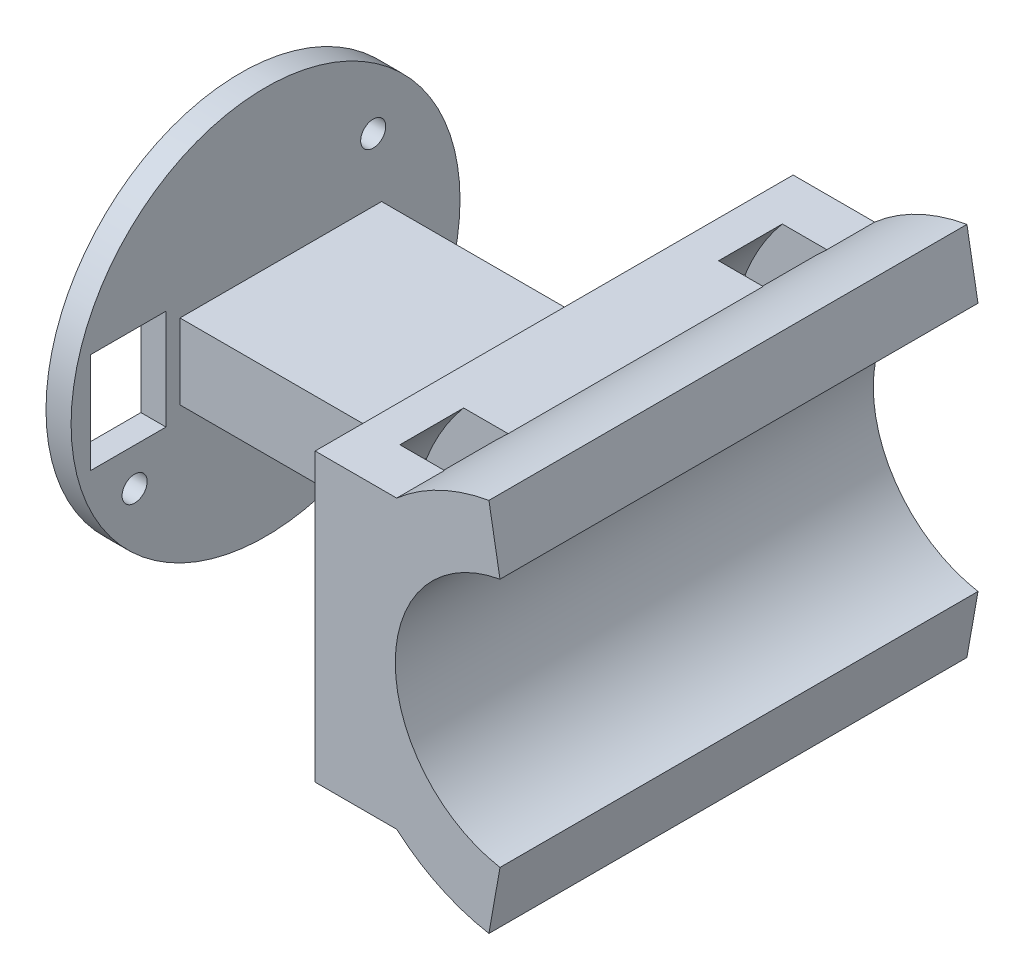
ISO-10303-21;
HEADER;
FILE_DESCRIPTION(('STEP AP214'),'2;1');
FILE_NAME('part.step','',(''),(''),'','','');
FILE_SCHEMA(('AUTOMOTIVE_DESIGN { 1 0 10303 214 1 1 1 1 }'));
ENDSEC;
DATA;
#1=APPLICATION_CONTEXT('core data for automotive mechanical design processes');
#2=APPLICATION_PROTOCOL_DEFINITION('international standard','automotive_design',2000,#1);
#3=PRODUCT_CONTEXT('',#1,'mechanical');
#4=PRODUCT('Part','Part','',(#3));
#5=PRODUCT_RELATED_PRODUCT_CATEGORY('part','',(#4));
#6=PRODUCT_DEFINITION_FORMATION('','',#4);
#7=PRODUCT_DEFINITION_CONTEXT('part definition',#1,'design');
#8=PRODUCT_DEFINITION('design','',#6,#7);
#9=PRODUCT_DEFINITION_SHAPE('','',#8);
#10=(LENGTH_UNIT() NAMED_UNIT(*) SI_UNIT(.MILLI.,.METRE.));
#11=(NAMED_UNIT(*) PLANE_ANGLE_UNIT() SI_UNIT($,.RADIAN.));
#12=(NAMED_UNIT(*) SI_UNIT($,.STERADIAN.) SOLID_ANGLE_UNIT());
#13=UNCERTAINTY_MEASURE_WITH_UNIT(LENGTH_MEASURE(1.E-05),#10,'distance_accuracy_value','');
#14=(GEOMETRIC_REPRESENTATION_CONTEXT(3) GLOBAL_UNCERTAINTY_ASSIGNED_CONTEXT((#13)) GLOBAL_UNIT_ASSIGNED_CONTEXT((#10,
#11,#12)) REPRESENTATION_CONTEXT('',''));
#15=CARTESIAN_POINT('',(0.,0.,0.));
#16=DIRECTION('',(0.,0.,1.));
#17=DIRECTION('',(1.,0.,0.));
#18=AXIS2_PLACEMENT_3D('',#15,#16,#17);
#19=CARTESIAN_POINT('',(-6.38936934946346,-11.43,19.05));
#20=DIRECTION('',(1.,0.,0.));
#21=DIRECTION('',(0.,1.,0.));
#22=AXIS2_PLACEMENT_3D('',#19,#20,#21);
#23=PLANE('',#22);
#24=DIRECTION('',(0.,0.,1.));
#25=VECTOR('',#24,1.);
#26=CARTESIAN_POINT('',(-6.38936934946345,-6.48838180573363,19.05));
#27=LINE('',#26,#25);
#28=CARTESIAN_POINT('',(-6.38936934946345,-6.48838180573363,-15.24));
#29=VERTEX_POINT('',#28);
#30=CARTESIAN_POINT('',(-6.38936934946346,-6.48838180573361,-10.16));
#31=VERTEX_POINT('',#30);
#32=EDGE_CURVE('E345',#29,#31,#27,.T.);
#33=ORIENTED_EDGE('',*,*,#32,.F.);
#34=DIRECTION('',(0.,1.,0.));
#35=VECTOR('',#34,1.);
#36=CARTESIAN_POINT('',(-6.38936934946346,-11.43,-15.24));
#37=LINE('',#36,#35);
#38=CARTESIAN_POINT('',(-6.38936934946345,6.48838180573364,-15.24));
#39=VERTEX_POINT('',#38);
#40=EDGE_CURVE('E330',#29,#39,#37,.T.);
#41=ORIENTED_EDGE('',*,*,#40,.T.);
#42=DIRECTION('',(0.,0.,1.));
#43=VECTOR('',#42,1.);
#44=CARTESIAN_POINT('',(-6.38936934946345,6.48838180573364,19.05));
#45=LINE('',#44,#43);
#46=CARTESIAN_POINT('',(-6.38936934946346,6.48838180573362,-10.16));
#47=VERTEX_POINT('',#46);
#48=EDGE_CURVE('E347',#47,#39,#45,.F.);
#49=ORIENTED_EDGE('',*,*,#48,.F.);
#50=DIRECTION('',(0.,1.,0.));
#51=VECTOR('',#50,1.);
#52=CARTESIAN_POINT('',(-6.38936934946346,-11.43,-10.16));
#53=LINE('',#52,#51);
#54=EDGE_CURVE('E322',#31,#47,#53,.T.);
#55=ORIENTED_EDGE('',*,*,#54,.F.);
#56=EDGE_LOOP('',(#33,#41,#49,#55));
#57=FACE_BOUND('',#56,.T.);
#58=DIRECTION('',(0.,-1.,0.));
#59=VECTOR('',#58,1.);
#60=CARTESIAN_POINT('',(-6.38936934946346,-3.,-9.2493893907033));
#61=LINE('',#60,#59);
#62=CARTESIAN_POINT('',(-6.38936934946346,3.,-9.2493893907033));
#63=VERTEX_POINT('',#62);
#64=CARTESIAN_POINT('',(-6.38936934946346,-3.,-9.2493893907033));
#65=VERTEX_POINT('',#64);
#66=EDGE_CURVE('E349',#63,#65,#61,.T.);
#67=ORIENTED_EDGE('',*,*,#66,.F.);
#68=DIRECTION('',(0.,0.,-1.));
#69=VECTOR('',#68,1.);
#70=CARTESIAN_POINT('',(-6.38936934946346,3.,-9.2493893907033));
#71=LINE('',#70,#69);
#72=CARTESIAN_POINT('',(-6.38936934946346,3.,6.82201027291285));
#73=VERTEX_POINT('',#72);
#74=EDGE_CURVE('E354',#73,#63,#71,.T.);
#75=ORIENTED_EDGE('',*,*,#74,.F.);
#76=DIRECTION('',(0.,1.,0.));
#77=VECTOR('',#76,1.);
#78=CARTESIAN_POINT('',(-6.38936934946346,-3.,6.82201027291285));
#79=LINE('',#78,#77);
#80=CARTESIAN_POINT('',(-6.38936934946346,-3.,6.82201027291285));
#81=VERTEX_POINT('',#80);
#82=EDGE_CURVE('E369',#81,#73,#79,.T.);
#83=ORIENTED_EDGE('',*,*,#82,.F.);
#84=DIRECTION('',(0.,0.,1.));
#85=VECTOR('',#84,1.);
#86=CARTESIAN_POINT('',(-6.38936934946346,-3.,-9.2493893907033));
#87=LINE('',#86,#85);
#88=EDGE_CURVE('E366',#65,#81,#87,.T.);
#89=ORIENTED_EDGE('',*,*,#88,.F.);
#90=EDGE_LOOP('',(#67,#75,#83,#89));
#91=FACE_BOUND('',#90,.T.);
#92=DIRECTION('',(0.,-1.,0.));
#93=VECTOR('',#92,1.);
#94=CARTESIAN_POINT('',(-6.38936934946346,-11.43,-19.05));
#95=LINE('',#94,#93);
#96=CARTESIAN_POINT('',(-6.38936934946346,11.43,-19.05));
#97=VERTEX_POINT('',#96);
#98=CARTESIAN_POINT('',(-6.38936934946346,-11.43,-19.05));
#99=VERTEX_POINT('',#98);
#100=EDGE_CURVE('E415',#97,#99,#95,.T.);
#101=ORIENTED_EDGE('',*,*,#100,.T.);
#102=DIRECTION('',(0.,0.,-1.));
#103=VECTOR('',#102,1.);
#104=CARTESIAN_POINT('',(-6.38936934946346,-11.43,19.05));
#105=LINE('',#104,#103);
#106=CARTESIAN_POINT('',(-6.38936934946346,-11.43,19.05));
#107=VERTEX_POINT('',#106);
#108=EDGE_CURVE('E432',#107,#99,#105,.T.);
#109=ORIENTED_EDGE('',*,*,#108,.F.);
#110=DIRECTION('',(0.,-1.,0.));
#111=VECTOR('',#110,1.);
#112=CARTESIAN_POINT('',(-6.38936934946346,-11.43,19.05));
#113=LINE('',#112,#111);
#114=CARTESIAN_POINT('',(-6.38936934946346,11.43,19.05));
#115=VERTEX_POINT('',#114);
#116=EDGE_CURVE('E396',#115,#107,#113,.T.);
#117=ORIENTED_EDGE('',*,*,#116,.F.);
#118=DIRECTION('',(0.,0.,-1.));
#119=VECTOR('',#118,1.);
#120=CARTESIAN_POINT('',(-6.38936934946346,11.43,19.05));
#121=LINE('',#120,#119);
#122=EDGE_CURVE('E436',#115,#97,#121,.T.);
#123=ORIENTED_EDGE('',*,*,#122,.T.);
#124=EDGE_LOOP('',(#101,#109,#117,#123));
#125=FACE_BOUND('',#124,.T.);
#126=DIRECTION('',(0.,1.,0.));
#127=VECTOR('',#126,1.);
#128=CARTESIAN_POINT('',(-6.38936934946346,-11.43,15.24));
#129=LINE('',#128,#127);
#130=CARTESIAN_POINT('',(-6.38936934946346,-6.48838180573362,15.24));
#131=VERTEX_POINT('',#130);
#132=CARTESIAN_POINT('',(-6.38936934946346,6.48838180573363,15.24));
#133=VERTEX_POINT('',#132);
#134=EDGE_CURVE('E316',#131,#133,#129,.T.);
#135=ORIENTED_EDGE('',*,*,#134,.F.);
#136=DIRECTION('',(0.,0.,1.));
#137=VECTOR('',#136,1.);
#138=CARTESIAN_POINT('',(-6.38936934946345,-6.48838180573364,19.05));
#139=LINE('',#138,#137);
#140=CARTESIAN_POINT('',(-6.38936934946346,-6.48838180573362,10.16));
#141=VERTEX_POINT('',#140);
#142=EDGE_CURVE('E336',#131,#141,#139,.F.);
#143=ORIENTED_EDGE('',*,*,#142,.T.);
#144=DIRECTION('',(0.,1.,0.));
#145=VECTOR('',#144,1.);
#146=CARTESIAN_POINT('',(-6.38936934946346,-11.43,10.16));
#147=LINE('',#146,#145);
#148=CARTESIAN_POINT('',(-6.38936934946346,6.48838180573363,10.16));
#149=VERTEX_POINT('',#148);
#150=EDGE_CURVE('E309',#141,#149,#147,.T.);
#151=ORIENTED_EDGE('',*,*,#150,.T.);
#152=DIRECTION('',(0.,0.,1.));
#153=VECTOR('',#152,1.);
#154=CARTESIAN_POINT('',(-6.38936934946345,6.48838180573365,19.05));
#155=LINE('',#154,#153);
#156=EDGE_CURVE('E339',#149,#133,#155,.T.);
#157=ORIENTED_EDGE('',*,*,#156,.T.);
#158=EDGE_LOOP('',(#135,#143,#151,#157));
#159=FACE_BOUND('',#158,.T.);
#160=ADVANCED_FACE('F45',(#57,#91,#125,#159),#23,.F.);
#161=CARTESIAN_POINT('',(0.110630650536534,11.43,19.05));
#162=DIRECTION('',(0.,-1.,0.));
#163=DIRECTION('',(1.,0.,0.));
#164=AXIS2_PLACEMENT_3D('',#161,#162,#163);
#165=PLANE('',#164);
#166=DIRECTION('',(0.,0.,1.));
#167=VECTOR('',#166,1.);
#168=CARTESIAN_POINT('',(-3.44080869076881,11.43,19.05));
#169=LINE('',#168,#167);
#170=CARTESIAN_POINT('',(-3.44080869076881,11.43,-15.24));
#171=VERTEX_POINT('',#170);
#172=CARTESIAN_POINT('',(-3.44080869076881,11.43,-10.16));
#173=VERTEX_POINT('',#172);
#174=EDGE_CURVE('E342',#171,#173,#169,.T.);
#175=ORIENTED_EDGE('',*,*,#174,.F.);
#176=DIRECTION('',(1.,0.,0.));
#177=VECTOR('',#176,1.);
#178=CARTESIAN_POINT('',(0.110630650536534,11.43,-15.24));
#179=LINE('',#178,#177);
#180=CARTESIAN_POINT('',(0.110630650536533,11.43,-15.24));
#181=VERTEX_POINT('',#180);
#182=EDGE_CURVE('E327',#171,#181,#179,.T.);
#183=ORIENTED_EDGE('',*,*,#182,.T.);
#184=DIRECTION('',(0.,0.,-1.));
#185=VECTOR('',#184,1.);
#186=CARTESIAN_POINT('',(0.110630650536534,11.43,19.05));
#187=LINE('',#186,#185);
#188=CARTESIAN_POINT('',(0.110630650536534,11.43,-19.05));
#189=VERTEX_POINT('',#188);
#190=EDGE_CURVE('E439',#181,#189,#187,.T.);
#191=ORIENTED_EDGE('',*,*,#190,.T.);
#192=DIRECTION('',(-1.,0.,0.));
#193=VECTOR('',#192,1.);
#194=CARTESIAN_POINT('',(0.110630650536534,11.43,-19.05));
#195=LINE('',#194,#193);
#196=EDGE_CURVE('E413',#189,#97,#195,.T.);
#197=ORIENTED_EDGE('',*,*,#196,.T.);
#198=ORIENTED_EDGE('',*,*,#122,.F.);
#199=DIRECTION('',(-1.,0.,0.));
#200=VECTOR('',#199,1.);
#201=CARTESIAN_POINT('',(0.110630650536534,11.43,19.05));
#202=LINE('',#201,#200);
#203=CARTESIAN_POINT('',(0.110630650536534,11.43,19.05));
#204=VERTEX_POINT('',#203);
#205=EDGE_CURVE('E394',#204,#115,#202,.T.);
#206=ORIENTED_EDGE('',*,*,#205,.F.);
#207=CARTESIAN_POINT('',(0.110630650536528,11.43,15.24));
#208=VERTEX_POINT('',#207);
#209=EDGE_CURVE('E440',#204,#208,#187,.T.);
#210=ORIENTED_EDGE('',*,*,#209,.T.);
#211=DIRECTION('',(1.,0.,0.));
#212=VECTOR('',#211,1.);
#213=CARTESIAN_POINT('',(0.110630650536534,11.43,15.24));
#214=LINE('',#213,#212);
#215=CARTESIAN_POINT('',(-3.44080869076881,11.43,15.24));
#216=VERTEX_POINT('',#215);
#217=EDGE_CURVE('E314',#216,#208,#214,.T.);
#218=ORIENTED_EDGE('',*,*,#217,.F.);
#219=DIRECTION('',(0.,0.,1.));
#220=VECTOR('',#219,1.);
#221=CARTESIAN_POINT('',(-3.44080869076881,11.43,19.05));
#222=LINE('',#221,#220);
#223=CARTESIAN_POINT('',(-3.44080869076881,11.43,10.16));
#224=VERTEX_POINT('',#223);
#225=EDGE_CURVE('E333',#216,#224,#222,.F.);
#226=ORIENTED_EDGE('',*,*,#225,.T.);
#227=DIRECTION('',(1.,0.,0.));
#228=VECTOR('',#227,1.);
#229=CARTESIAN_POINT('',(0.110630650536534,11.43,10.16));
#230=LINE('',#229,#228);
#231=CARTESIAN_POINT('',(0.110630650536534,11.43,10.16));
#232=VERTEX_POINT('',#231);
#233=EDGE_CURVE('E306',#224,#232,#230,.T.);
#234=ORIENTED_EDGE('',*,*,#233,.T.);
#235=CARTESIAN_POINT('',(0.110630650536537,11.43,-10.16));
#236=VERTEX_POINT('',#235);
#237=EDGE_CURVE('E444',#232,#236,#187,.T.);
#238=ORIENTED_EDGE('',*,*,#237,.T.);
#239=DIRECTION('',(1.,0.,0.));
#240=VECTOR('',#239,1.);
#241=CARTESIAN_POINT('',(0.110630650536534,11.43,-10.16));
#242=LINE('',#241,#240);
#243=EDGE_CURVE('E320',#173,#236,#242,.T.);
#244=ORIENTED_EDGE('',*,*,#243,.F.);
#245=EDGE_LOOP('',(#175,#183,#191,#197,#198,#206,#210,#218,#226,#234,#238,#244));
#246=FACE_BOUND('',#245,.T.);
#247=ADVANCED_FACE('F472',(#246),#165,.F.);
#248=CARTESIAN_POINT('',(0.110630650536537,-11.43,19.05));
#249=DIRECTION('',(0.,1.,0.));
#250=DIRECTION('',(-1.,0.,0.));
#251=AXIS2_PLACEMENT_3D('',#248,#249,#250);
#252=PLANE('',#251);
#253=DIRECTION('',(0.,0.,-1.));
#254=VECTOR('',#253,1.);
#255=CARTESIAN_POINT('',(0.11063065053654,-11.43,19.05));
#256=LINE('',#255,#254);
#257=CARTESIAN_POINT('',(0.110630650536542,-11.43,-15.24));
#258=VERTEX_POINT('',#257);
#259=CARTESIAN_POINT('',(0.11063065053654,-11.43,-19.05));
#260=VERTEX_POINT('',#259);
#261=EDGE_CURVE('E428',#258,#260,#256,.T.);
#262=ORIENTED_EDGE('',*,*,#261,.F.);
#263=DIRECTION('',(-1.,0.,0.));
#264=VECTOR('',#263,1.);
#265=CARTESIAN_POINT('',(0.110630650536537,-11.43,-15.24));
#266=LINE('',#265,#264);
#267=CARTESIAN_POINT('',(-3.4408086907688,-11.43,-15.24));
#268=VERTEX_POINT('',#267);
#269=EDGE_CURVE('E324',#258,#268,#266,.T.);
#270=ORIENTED_EDGE('',*,*,#269,.T.);
#271=DIRECTION('',(0.,0.,1.));
#272=VECTOR('',#271,1.);
#273=CARTESIAN_POINT('',(-3.4408086907688,-11.43,19.05));
#274=LINE('',#273,#272);
#275=CARTESIAN_POINT('',(-3.4408086907688,-11.43,-10.16));
#276=VERTEX_POINT('',#275);
#277=EDGE_CURVE('E11',#276,#268,#274,.F.);
#278=ORIENTED_EDGE('',*,*,#277,.F.);
#279=DIRECTION('',(-1.,0.,0.));
#280=VECTOR('',#279,1.);
#281=CARTESIAN_POINT('',(0.110630650536537,-11.43,-10.16));
#282=LINE('',#281,#280);
#283=CARTESIAN_POINT('',(0.11063065053654,-11.43,-10.16));
#284=VERTEX_POINT('',#283);
#285=EDGE_CURVE('E318',#284,#276,#282,.T.);
#286=ORIENTED_EDGE('',*,*,#285,.F.);
#287=CARTESIAN_POINT('',(0.11063065053654,-11.43,10.16));
#288=VERTEX_POINT('',#287);
#289=EDGE_CURVE('E433',#288,#284,#256,.T.);
#290=ORIENTED_EDGE('',*,*,#289,.F.);
#291=DIRECTION('',(-1.,0.,0.));
#292=VECTOR('',#291,1.);
#293=CARTESIAN_POINT('',(0.110630650536537,-11.43,10.16));
#294=LINE('',#293,#292);
#295=CARTESIAN_POINT('',(-3.44080869076881,-11.43,10.16));
#296=VERTEX_POINT('',#295);
#297=EDGE_CURVE('E294',#288,#296,#294,.T.);
#298=ORIENTED_EDGE('',*,*,#297,.T.);
#299=DIRECTION('',(0.,0.,1.));
#300=VECTOR('',#299,1.);
#301=CARTESIAN_POINT('',(-3.44080869076881,-11.43,19.05));
#302=LINE('',#301,#300);
#303=CARTESIAN_POINT('',(-3.44080869076881,-11.43,15.24));
#304=VERTEX_POINT('',#303);
#305=EDGE_CURVE('E53',#296,#304,#302,.T.);
#306=ORIENTED_EDGE('',*,*,#305,.T.);
#307=DIRECTION('',(-1.,0.,0.));
#308=VECTOR('',#307,1.);
#309=CARTESIAN_POINT('',(0.110630650536537,-11.43,15.24));
#310=LINE('',#309,#308);
#311=CARTESIAN_POINT('',(0.11063065053654,-11.43,15.24));
#312=VERTEX_POINT('',#311);
#313=EDGE_CURVE('E312',#312,#304,#310,.T.);
#314=ORIENTED_EDGE('',*,*,#313,.F.);
#315=CARTESIAN_POINT('',(0.11063065053654,-11.43,19.05));
#316=VERTEX_POINT('',#315);
#317=EDGE_CURVE('E429',#316,#312,#256,.T.);
#318=ORIENTED_EDGE('',*,*,#317,.F.);
#319=DIRECTION('',(1.,0.,0.));
#320=VECTOR('',#319,1.);
#321=CARTESIAN_POINT('',(0.110630650536537,-11.43,19.05));
#322=LINE('',#321,#320);
#323=EDGE_CURVE('E398',#107,#316,#322,.T.);
#324=ORIENTED_EDGE('',*,*,#323,.F.);
#325=ORIENTED_EDGE('',*,*,#108,.T.);
#326=DIRECTION('',(1.,0.,0.));
#327=VECTOR('',#326,1.);
#328=CARTESIAN_POINT('',(0.110630650536537,-11.43,-19.05));
#329=LINE('',#328,#327);
#330=EDGE_CURVE('E417',#99,#260,#329,.T.);
#331=ORIENTED_EDGE('',*,*,#330,.T.);
#332=EDGE_LOOP('',(#262,#270,#278,#286,#290,#298,#306,#314,#318,#324,#325,#331));
#333=FACE_BOUND('',#332,.T.);
#334=ADVANCED_FACE('F453',(#333),#252,.F.);
#335=CARTESIAN_POINT('',(10.1,0.,19.05));
#336=DIRECTION('',(0.,0.,-1.));
#337=DIRECTION('',(-1.,0.,0.));
#338=AXIS2_PLACEMENT_3D('',#335,#336,#337);
#339=CYLINDRICAL_SURFACE('',#338,10.1);
#340=CARTESIAN_POINT('',(10.1,0.,-19.05));
#341=DIRECTION('',(0.,0.,-1.));
#342=DIRECTION('',(-1.,0.,0.));
#343=AXIS2_PLACEMENT_3D('',#340,#341,#342);
#344=CIRCLE('',#343,10.1);
#345=CARTESIAN_POINT('',(8.34615340556399,-9.9465583054233,-19.05));
#346=VERTEX_POINT('',#345);
#347=CARTESIAN_POINT('',(8.34615340556399,9.9465583054233,-19.05));
#348=VERTEX_POINT('',#347);
#349=EDGE_CURVE('E385',#346,#348,#344,.T.);
#350=ORIENTED_EDGE('',*,*,#349,.T.);
#351=DIRECTION('',(0.,0.,-1.));
#352=VECTOR('',#351,1.);
#353=CARTESIAN_POINT('',(8.34615340556399,9.9465583054233,19.05));
#354=LINE('',#353,#352);
#355=CARTESIAN_POINT('',(8.34615340556399,9.9465583054233,19.05));
#356=VERTEX_POINT('',#355);
#357=EDGE_CURVE('E446',#356,#348,#354,.T.);
#358=ORIENTED_EDGE('',*,*,#357,.F.);
#359=CARTESIAN_POINT('',(10.1,0.,19.05));
#360=DIRECTION('',(0.,0.,-1.));
#361=DIRECTION('',(-1.,0.,0.));
#362=AXIS2_PLACEMENT_3D('',#359,#360,#361);
#363=CIRCLE('',#362,10.1);
#364=CARTESIAN_POINT('',(8.34615340556399,-9.9465583054233,19.05));
#365=VERTEX_POINT('',#364);
#366=EDGE_CURVE('E386',#365,#356,#363,.T.);
#367=ORIENTED_EDGE('',*,*,#366,.F.);
#368=DIRECTION('',(0.,0.,-1.));
#369=VECTOR('',#368,1.);
#370=CARTESIAN_POINT('',(8.34615340556399,-9.9465583054233,19.05));
#371=LINE('',#370,#369);
#372=EDGE_CURVE('E404',#365,#346,#371,.T.);
#373=ORIENTED_EDGE('',*,*,#372,.T.);
#374=EDGE_LOOP('',(#350,#358,#367,#373));
#375=FACE_BOUND('',#374,.T.);
#376=ADVANCED_FACE('F47',(#375),#339,.F.);
#377=CARTESIAN_POINT('',(8.34615340556399,9.9465583054233,19.05));
#378=DIRECTION('',(-0.984807753012208,-0.173648177666931,0.));
#379=DIRECTION('',(0.173648177666931,-0.984807753012208,0.));
#380=AXIS2_PLACEMENT_3D('',#377,#378,#379);
#381=PLANE('',#380);
#382=DIRECTION('',(-0.173648177666931,0.984807753012208,0.));
#383=VECTOR('',#382,1.);
#384=CARTESIAN_POINT('',(8.34615340556399,9.9465583054233,-19.05));
#385=LINE('',#384,#383);
#386=CARTESIAN_POINT('',(7.46402066301598,14.9493816907253,-19.05));
#387=VERTEX_POINT('',#386);
#388=EDGE_CURVE('E407',#348,#387,#385,.T.);
#389=ORIENTED_EDGE('',*,*,#388,.T.);
#390=DIRECTION('',(0.,0.,-1.));
#391=VECTOR('',#390,1.);
#392=CARTESIAN_POINT('',(7.46402066301598,14.9493816907253,19.05));
#393=LINE('',#392,#391);
#394=CARTESIAN_POINT('',(7.46402066301598,14.9493816907253,19.05));
#395=VERTEX_POINT('',#394);
#396=EDGE_CURVE('E443',#395,#387,#393,.T.);
#397=ORIENTED_EDGE('',*,*,#396,.F.);
#398=DIRECTION('',(-0.173648177666931,0.984807753012208,0.));
#399=VECTOR('',#398,1.);
#400=CARTESIAN_POINT('',(8.34615340556399,9.9465583054233,19.05));
#401=LINE('',#400,#399);
#402=EDGE_CURVE('E389',#356,#395,#401,.T.);
#403=ORIENTED_EDGE('',*,*,#402,.F.);
#404=ORIENTED_EDGE('',*,*,#357,.T.);
#405=EDGE_LOOP('',(#389,#397,#403,#404));
#406=FACE_BOUND('',#405,.T.);
#407=ADVANCED_FACE('F521',(#406),#381,.F.);
#408=CARTESIAN_POINT('',(10.1,0.,19.05));
#409=DIRECTION('',(0.,0.,-1.));
#410=DIRECTION('',(-1.,0.,0.));
#411=AXIS2_PLACEMENT_3D('',#408,#409,#410);
#412=CYLINDRICAL_SURFACE('',#411,15.18);
#413=ORIENTED_EDGE('',*,*,#396,.T.);
#414=CARTESIAN_POINT('',(10.1,0.,-19.05));
#415=DIRECTION('',(0.,0.,1.));
#416=DIRECTION('',(-1.,0.,0.));
#417=AXIS2_PLACEMENT_3D('',#414,#415,#416);
#418=CIRCLE('',#417,15.18);
#419=EDGE_CURVE('E410',#387,#189,#418,.T.);
#420=ORIENTED_EDGE('',*,*,#419,.T.);
#421=ORIENTED_EDGE('',*,*,#190,.F.);
#422=CARTESIAN_POINT('',(10.1,0.,-15.24));
#423=DIRECTION('',(0.,0.,1.));
#424=DIRECTION('',(1.,0.,0.));
#425=AXIS2_PLACEMENT_3D('',#422,#423,#424);
#426=CIRCLE('',#425,15.18);
#427=EDGE_CURVE('E291',#181,#258,#426,.T.);
#428=ORIENTED_EDGE('',*,*,#427,.T.);
#429=ORIENTED_EDGE('',*,*,#261,.T.);
#430=CARTESIAN_POINT('',(10.1,0.,-19.05));
#431=DIRECTION('',(0.,0.,1.));
#432=DIRECTION('',(-1.,0.,0.));
#433=AXIS2_PLACEMENT_3D('',#430,#431,#432);
#434=CIRCLE('',#433,15.18);
#435=CARTESIAN_POINT('',(7.46402066301598,-14.9493816907253,-19.05));
#436=VERTEX_POINT('',#435);
#437=EDGE_CURVE('E420',#260,#436,#434,.T.);
#438=ORIENTED_EDGE('',*,*,#437,.T.);
#439=DIRECTION('',(0.,0.,-1.));
#440=VECTOR('',#439,1.);
#441=CARTESIAN_POINT('',(7.46402066301598,-14.9493816907253,19.05));
#442=LINE('',#441,#440);
#443=CARTESIAN_POINT('',(7.46402066301598,-14.9493816907253,19.05));
#444=VERTEX_POINT('',#443);
#445=EDGE_CURVE('E426',#444,#436,#442,.T.);
#446=ORIENTED_EDGE('',*,*,#445,.F.);
#447=CARTESIAN_POINT('',(10.1,0.,19.05));
#448=DIRECTION('',(0.,0.,1.));
#449=DIRECTION('',(-1.,0.,0.));
#450=AXIS2_PLACEMENT_3D('',#447,#448,#449);
#451=CIRCLE('',#450,15.18);
#452=EDGE_CURVE('E400',#316,#444,#451,.T.);
#453=ORIENTED_EDGE('',*,*,#452,.F.);
#454=ORIENTED_EDGE('',*,*,#317,.T.);
#455=CARTESIAN_POINT('',(10.1,0.,15.24));
#456=DIRECTION('',(0.,0.,1.));
#457=DIRECTION('',(1.,0.,0.));
#458=AXIS2_PLACEMENT_3D('',#455,#456,#457);
#459=CIRCLE('',#458,15.18);
#460=EDGE_CURVE('E299',#208,#312,#459,.T.);
#461=ORIENTED_EDGE('',*,*,#460,.F.);
#462=ORIENTED_EDGE('',*,*,#209,.F.);
#463=CARTESIAN_POINT('',(10.1,0.,19.05));
#464=DIRECTION('',(0.,0.,1.));
#465=DIRECTION('',(-1.,0.,0.));
#466=AXIS2_PLACEMENT_3D('',#463,#464,#465);
#467=CIRCLE('',#466,15.18);
#468=EDGE_CURVE('E392',#395,#204,#467,.T.);
#469=ORIENTED_EDGE('',*,*,#468,.F.);
#470=EDGE_LOOP('',(#413,#420,#421,#428,#429,#438,#446,#453,#454,#461,#462,#469));
#471=FACE_BOUND('',#470,.T.);
#472=CARTESIAN_POINT('',(10.1,0.,-10.16));
#473=DIRECTION('',(0.,0.,1.));
#474=DIRECTION('',(1.,0.,0.));
#475=AXIS2_PLACEMENT_3D('',#472,#473,#474);
#476=CIRCLE('',#475,15.18);
#477=EDGE_CURVE('E281',#236,#284,#476,.T.);
#478=ORIENTED_EDGE('',*,*,#477,.F.);
#479=ORIENTED_EDGE('',*,*,#237,.F.);
#480=CARTESIAN_POINT('',(10.1,0.,10.16));
#481=DIRECTION('',(0.,0.,1.));
#482=DIRECTION('',(1.,0.,0.));
#483=AXIS2_PLACEMENT_3D('',#480,#481,#482);
#484=CIRCLE('',#483,15.18);
#485=EDGE_CURVE('E296',#232,#288,#484,.T.);
#486=ORIENTED_EDGE('',*,*,#485,.T.);
#487=ORIENTED_EDGE('',*,*,#289,.T.);
#488=EDGE_LOOP('',(#478,#479,#486,#487));
#489=FACE_BOUND('',#488,.T.);
#490=ADVANCED_FACE('F478',(#471,#489),#412,.T.);
#491=CARTESIAN_POINT('',(8.34615340556399,-9.9465583054233,19.05));
#492=DIRECTION('',(-0.984807753012208,0.173648177666931,0.));
#493=DIRECTION('',(-0.173648177666931,-0.984807753012208,0.));
#494=AXIS2_PLACEMENT_3D('',#491,#492,#493);
#495=PLANE('',#494);
#496=DIRECTION('',(0.173648177666931,0.984807753012208,0.));
#497=VECTOR('',#496,1.);
#498=CARTESIAN_POINT('',(8.34615340556399,-9.9465583054233,-19.05));
#499=LINE('',#498,#497);
#500=EDGE_CURVE('E390',#436,#346,#499,.T.);
#501=ORIENTED_EDGE('',*,*,#500,.T.);
#502=ORIENTED_EDGE('',*,*,#372,.F.);
#503=DIRECTION('',(0.173648177666931,0.984807753012208,0.));
#504=VECTOR('',#503,1.);
#505=CARTESIAN_POINT('',(8.34615340556399,-9.9465583054233,19.05));
#506=LINE('',#505,#504);
#507=EDGE_CURVE('E402',#444,#365,#506,.T.);
#508=ORIENTED_EDGE('',*,*,#507,.F.);
#509=ORIENTED_EDGE('',*,*,#445,.T.);
#510=EDGE_LOOP('',(#501,#502,#508,#509));
#511=FACE_BOUND('',#510,.T.);
#512=ADVANCED_FACE('F527',(#511),#495,.F.);
#513=CARTESIAN_POINT('',(10.1,0.,19.05));
#514=DIRECTION('',(0.,0.,-1.));
#515=DIRECTION('',(-1.,0.,0.));
#516=AXIS2_PLACEMENT_3D('',#513,#514,#515);
#517=PLANE('',#516);
#518=ORIENTED_EDGE('',*,*,#366,.T.);
#519=ORIENTED_EDGE('',*,*,#402,.T.);
#520=ORIENTED_EDGE('',*,*,#468,.T.);
#521=ORIENTED_EDGE('',*,*,#205,.T.);
#522=ORIENTED_EDGE('',*,*,#116,.T.);
#523=ORIENTED_EDGE('',*,*,#323,.T.);
#524=ORIENTED_EDGE('',*,*,#452,.T.);
#525=ORIENTED_EDGE('',*,*,#507,.T.);
#526=EDGE_LOOP('',(#518,#519,#520,#521,#522,#523,#524,#525));
#527=FACE_BOUND('',#526,.T.);
#528=ADVANCED_FACE('F486',(#527),#517,.F.);
#529=CARTESIAN_POINT('',(10.1,0.,-19.05));
#530=DIRECTION('',(0.,0.,-1.));
#531=DIRECTION('',(-1.,0.,0.));
#532=AXIS2_PLACEMENT_3D('',#529,#530,#531);
#533=PLANE('',#532);
#534=ORIENTED_EDGE('',*,*,#349,.F.);
#535=ORIENTED_EDGE('',*,*,#500,.F.);
#536=ORIENTED_EDGE('',*,*,#437,.F.);
#537=ORIENTED_EDGE('',*,*,#330,.F.);
#538=ORIENTED_EDGE('',*,*,#100,.F.);
#539=ORIENTED_EDGE('',*,*,#196,.F.);
#540=ORIENTED_EDGE('',*,*,#419,.F.);
#541=ORIENTED_EDGE('',*,*,#388,.F.);
#542=EDGE_LOOP('',(#534,#535,#536,#537,#538,#539,#540,#541));
#543=FACE_BOUND('',#542,.T.);
#544=ADVANCED_FACE('F493',(#543),#533,.T.);
#545=CARTESIAN_POINT('',(-29.3893693494635,-3.,-9.2493893907033));
#546=DIRECTION('',(0.,0.,1.));
#547=DIRECTION('',(1.,0.,0.));
#548=AXIS2_PLACEMENT_3D('',#545,#546,#547);
#549=PLANE('',#548);
#550=ORIENTED_EDGE('',*,*,#66,.T.);
#551=DIRECTION('',(1.,0.,0.));
#552=VECTOR('',#551,1.);
#553=CARTESIAN_POINT('',(-29.3893693494635,-3.,-9.2493893907033));
#554=LINE('',#553,#552);
#555=CARTESIAN_POINT('',(-29.3893693494635,-3.,-9.2493893907033));
#556=VERTEX_POINT('',#555);
#557=EDGE_CURVE('E382',#556,#65,#554,.T.);
#558=ORIENTED_EDGE('',*,*,#557,.F.);
#559=DIRECTION('',(0.,-1.,0.));
#560=VECTOR('',#559,1.);
#561=CARTESIAN_POINT('',(-29.3893693494635,-3.,-9.2493893907033));
#562=LINE('',#561,#560);
#563=CARTESIAN_POINT('',(-29.3893693494635,3.,-9.2493893907033));
#564=VERTEX_POINT('',#563);
#565=EDGE_CURVE('E350',#564,#556,#562,.T.);
#566=ORIENTED_EDGE('',*,*,#565,.F.);
#567=DIRECTION('',(1.,0.,0.));
#568=VECTOR('',#567,1.);
#569=CARTESIAN_POINT('',(-29.3893693494635,3.,-9.2493893907033));
#570=LINE('',#569,#568);
#571=EDGE_CURVE('E363',#564,#63,#570,.T.);
#572=ORIENTED_EDGE('',*,*,#571,.T.);
#573=EDGE_LOOP('',(#550,#558,#566,#572));
#574=FACE_BOUND('',#573,.T.);
#575=ADVANCED_FACE('F735',(#574),#549,.F.);
#576=CARTESIAN_POINT('',(-29.3893693494635,-3.,-9.2493893907033));
#577=DIRECTION('',(0.,1.,0.));
#578=DIRECTION('',(0.,0.,1.));
#579=AXIS2_PLACEMENT_3D('',#576,#577,#578);
#580=PLANE('',#579);
#581=ORIENTED_EDGE('',*,*,#88,.T.);
#582=DIRECTION('',(1.,0.,0.));
#583=VECTOR('',#582,1.);
#584=CARTESIAN_POINT('',(-29.3893693494635,-3.,6.82201027291285));
#585=LINE('',#584,#583);
#586=CARTESIAN_POINT('',(-29.3893693494635,-3.,6.82201027291285));
#587=VERTEX_POINT('',#586);
#588=EDGE_CURVE('E379',#587,#81,#585,.T.);
#589=ORIENTED_EDGE('',*,*,#588,.F.);
#590=DIRECTION('',(0.,0.,1.));
#591=VECTOR('',#590,1.);
#592=CARTESIAN_POINT('',(-29.3893693494635,-3.,-9.2493893907033));
#593=LINE('',#592,#591);
#594=EDGE_CURVE('E353',#556,#587,#593,.T.);
#595=ORIENTED_EDGE('',*,*,#594,.F.);
#596=ORIENTED_EDGE('',*,*,#557,.T.);
#597=EDGE_LOOP('',(#581,#589,#595,#596));
#598=FACE_BOUND('',#597,.T.);
#599=ADVANCED_FACE('F726',(#598),#580,.F.);
#600=CARTESIAN_POINT('',(-29.3893693494635,-3.,6.82201027291285));
#601=DIRECTION('',(0.,0.,-1.));
#602=DIRECTION('',(-1.,0.,0.));
#603=AXIS2_PLACEMENT_3D('',#600,#601,#602);
#604=PLANE('',#603);
#605=ORIENTED_EDGE('',*,*,#82,.T.);
#606=DIRECTION('',(1.,0.,0.));
#607=VECTOR('',#606,1.);
#608=CARTESIAN_POINT('',(-29.3893693494635,3.,6.82201027291285));
#609=LINE('',#608,#607);
#610=CARTESIAN_POINT('',(-29.3893693494635,3.,6.82201027291285));
#611=VERTEX_POINT('',#610);
#612=EDGE_CURVE('E376',#611,#73,#609,.T.);
#613=ORIENTED_EDGE('',*,*,#612,.F.);
#614=DIRECTION('',(0.,1.,0.));
#615=VECTOR('',#614,1.);
#616=CARTESIAN_POINT('',(-29.3893693494635,-3.,6.82201027291285));
#617=LINE('',#616,#615);
#618=EDGE_CURVE('E357',#587,#611,#617,.T.);
#619=ORIENTED_EDGE('',*,*,#618,.F.);
#620=ORIENTED_EDGE('',*,*,#588,.T.);
#621=EDGE_LOOP('',(#605,#613,#619,#620));
#622=FACE_BOUND('',#621,.T.);
#623=ADVANCED_FACE('F718',(#622),#604,.F.);
#624=CARTESIAN_POINT('',(-29.3893693494635,3.,-9.2493893907033));
#625=DIRECTION('',(0.,-1.,0.));
#626=DIRECTION('',(0.,0.,-1.));
#627=AXIS2_PLACEMENT_3D('',#624,#625,#626);
#628=PLANE('',#627);
#629=ORIENTED_EDGE('',*,*,#74,.T.);
#630=ORIENTED_EDGE('',*,*,#571,.F.);
#631=DIRECTION('',(0.,0.,-1.));
#632=VECTOR('',#631,1.);
#633=CARTESIAN_POINT('',(-29.3893693494635,3.,-9.2493893907033));
#634=LINE('',#633,#632);
#635=EDGE_CURVE('E360',#611,#564,#634,.T.);
#636=ORIENTED_EDGE('',*,*,#635,.F.);
#637=ORIENTED_EDGE('',*,*,#612,.T.);
#638=EDGE_LOOP('',(#629,#630,#636,#637));
#639=FACE_BOUND('',#638,.T.);
#640=ADVANCED_FACE('F573',(#639),#628,.F.);
#641=CARTESIAN_POINT('',(10.1,0.,19.05));
#642=DIRECTION('',(0.,0.,1.));
#643=DIRECTION('',(1.,0.,0.));
#644=AXIS2_PLACEMENT_3D('',#641,#642,#643);
#645=CYLINDRICAL_SURFACE('',#644,17.72);
#646=CARTESIAN_POINT('',(10.1,0.,10.16));
#647=DIRECTION('',(0.,0.,1.));
#648=DIRECTION('',(1.,0.,0.));
#649=AXIS2_PLACEMENT_3D('',#646,#647,#648);
#650=CIRCLE('',#649,17.72);
#651=EDGE_CURVE('E68',#224,#149,#650,.T.);
#652=ORIENTED_EDGE('',*,*,#651,.F.);
#653=ORIENTED_EDGE('',*,*,#225,.F.);
#654=CARTESIAN_POINT('',(10.1,0.,15.24));
#655=DIRECTION('',(0.,0.,1.));
#656=DIRECTION('',(1.,0.,0.));
#657=AXIS2_PLACEMENT_3D('',#654,#655,#656);
#658=CIRCLE('',#657,17.72);
#659=EDGE_CURVE('E283',#216,#133,#658,.T.);
#660=ORIENTED_EDGE('',*,*,#659,.T.);
#661=ORIENTED_EDGE('',*,*,#156,.F.);
#662=EDGE_LOOP('',(#652,#653,#660,#661));
#663=FACE_BOUND('',#662,.T.);
#664=ADVANCED_FACE('F467',(#663),#645,.F.);
#665=EDGE_CURVE('E301',#131,#304,#658,.T.);
#666=ORIENTED_EDGE('',*,*,#665,.T.);
#667=ORIENTED_EDGE('',*,*,#305,.F.);
#668=EDGE_CURVE('E278',#141,#296,#650,.T.);
#669=ORIENTED_EDGE('',*,*,#668,.F.);
#670=ORIENTED_EDGE('',*,*,#142,.F.);
#671=EDGE_LOOP('',(#666,#667,#669,#670));
#672=FACE_BOUND('',#671,.T.);
#673=ADVANCED_FACE('F459',(#672),#645,.F.);
#674=CARTESIAN_POINT('',(0.,0.,15.24));
#675=DIRECTION('',(0.,0.,-1.));
#676=DIRECTION('',(-1.,0.,0.));
#677=AXIS2_PLACEMENT_3D('',#674,#675,#676);
#678=PLANE('',#677);
#679=ORIENTED_EDGE('',*,*,#134,.T.);
#680=ORIENTED_EDGE('',*,*,#659,.F.);
#681=ORIENTED_EDGE('',*,*,#217,.T.);
#682=ORIENTED_EDGE('',*,*,#460,.T.);
#683=ORIENTED_EDGE('',*,*,#313,.T.);
#684=ORIENTED_EDGE('',*,*,#665,.F.);
#685=EDGE_LOOP('',(#679,#680,#681,#682,#683,#684));
#686=FACE_BOUND('',#685,.T.);
#687=ADVANCED_FACE('F463',(#686),#678,.T.);
#688=CARTESIAN_POINT('',(0.,0.,10.16));
#689=DIRECTION('',(0.,0.,-1.));
#690=DIRECTION('',(-1.,0.,0.));
#691=AXIS2_PLACEMENT_3D('',#688,#689,#690);
#692=PLANE('',#691);
#693=ORIENTED_EDGE('',*,*,#668,.T.);
#694=ORIENTED_EDGE('',*,*,#297,.F.);
#695=ORIENTED_EDGE('',*,*,#485,.F.);
#696=ORIENTED_EDGE('',*,*,#233,.F.);
#697=ORIENTED_EDGE('',*,*,#651,.T.);
#698=ORIENTED_EDGE('',*,*,#150,.F.);
#699=EDGE_LOOP('',(#693,#694,#695,#696,#697,#698));
#700=FACE_BOUND('',#699,.T.);
#701=ADVANCED_FACE('F588',(#700),#692,.F.);
#702=CARTESIAN_POINT('',(10.1,0.,19.05));
#703=DIRECTION('',(0.,0.,1.));
#704=DIRECTION('',(1.,0.,0.));
#705=AXIS2_PLACEMENT_3D('',#702,#703,#704);
#706=CYLINDRICAL_SURFACE('',#705,17.72);
#707=ORIENTED_EDGE('',*,*,#48,.T.);
#708=CARTESIAN_POINT('',(10.1,0.,-15.24));
#709=DIRECTION('',(0.,0.,1.));
#710=DIRECTION('',(1.,0.,0.));
#711=AXIS2_PLACEMENT_3D('',#708,#709,#710);
#712=CIRCLE('',#711,17.72);
#713=EDGE_CURVE('E288',#171,#39,#712,.T.);
#714=ORIENTED_EDGE('',*,*,#713,.F.);
#715=ORIENTED_EDGE('',*,*,#174,.T.);
#716=CARTESIAN_POINT('',(10.1,0.,-10.16));
#717=DIRECTION('',(0.,0.,1.));
#718=DIRECTION('',(1.,0.,0.));
#719=AXIS2_PLACEMENT_3D('',#716,#717,#718);
#720=CIRCLE('',#719,17.72);
#721=EDGE_CURVE('E284',#173,#47,#720,.T.);
#722=ORIENTED_EDGE('',*,*,#721,.T.);
#723=EDGE_LOOP('',(#707,#714,#715,#722));
#724=FACE_BOUND('',#723,.T.);
#725=ADVANCED_FACE('F514',(#724),#706,.F.);
#726=ORIENTED_EDGE('',*,*,#32,.T.);
#727=EDGE_CURVE('E60',#31,#276,#720,.T.);
#728=ORIENTED_EDGE('',*,*,#727,.T.);
#729=ORIENTED_EDGE('',*,*,#277,.T.);
#730=EDGE_CURVE('E287',#29,#268,#712,.T.);
#731=ORIENTED_EDGE('',*,*,#730,.F.);
#732=EDGE_LOOP('',(#726,#728,#729,#731));
#733=FACE_BOUND('',#732,.T.);
#734=ADVANCED_FACE('F505',(#733),#706,.F.);
#735=CARTESIAN_POINT('',(0.,0.,-15.24));
#736=DIRECTION('',(0.,0.,-1.));
#737=DIRECTION('',(-1.,0.,0.));
#738=AXIS2_PLACEMENT_3D('',#735,#736,#737);
#739=PLANE('',#738);
#740=ORIENTED_EDGE('',*,*,#730,.T.);
#741=ORIENTED_EDGE('',*,*,#269,.F.);
#742=ORIENTED_EDGE('',*,*,#427,.F.);
#743=ORIENTED_EDGE('',*,*,#182,.F.);
#744=ORIENTED_EDGE('',*,*,#713,.T.);
#745=ORIENTED_EDGE('',*,*,#40,.F.);
#746=EDGE_LOOP('',(#740,#741,#742,#743,#744,#745));
#747=FACE_BOUND('',#746,.T.);
#748=ADVANCED_FACE('F610',(#747),#739,.F.);
#749=CARTESIAN_POINT('',(0.,0.,-10.16));
#750=DIRECTION('',(0.,0.,-1.));
#751=DIRECTION('',(-1.,0.,0.));
#752=AXIS2_PLACEMENT_3D('',#749,#750,#751);
#753=PLANE('',#752);
#754=ORIENTED_EDGE('',*,*,#54,.T.);
#755=ORIENTED_EDGE('',*,*,#721,.F.);
#756=ORIENTED_EDGE('',*,*,#243,.T.);
#757=ORIENTED_EDGE('',*,*,#477,.T.);
#758=ORIENTED_EDGE('',*,*,#285,.T.);
#759=ORIENTED_EDGE('',*,*,#727,.F.);
#760=EDGE_LOOP('',(#754,#755,#756,#757,#758,#759));
#761=FACE_BOUND('',#760,.T.);
#762=ADVANCED_FACE('F503',(#761),#753,.T.);
#763=CARTESIAN_POINT('',(-29.3893693494635,0.,0.));
#764=DIRECTION('',(-1.,0.,0.));
#765=DIRECTION('',(0.,0.,1.));
#766=AXIS2_PLACEMENT_3D('',#763,#764,#765);
#767=PLANE('',#766);
#768=CARTESIAN_POINT('',(-29.3893693494635,0.,0.));
#769=DIRECTION('',(-1.,0.,0.));
#770=DIRECTION('',(0.,0.,1.));
#771=AXIS2_PLACEMENT_3D('',#768,#769,#770);
#772=CIRCLE('',#771,15.5);
#773=CARTESIAN_POINT('',(-29.3893693494635,0.,15.5));
#774=VERTEX_POINT('',#773);
#775=EDGE_CURVE('E248',#774,#774,#772,.T.);
#776=ORIENTED_EDGE('',*,*,#775,.F.);
#777=EDGE_LOOP('',(#776));
#778=FACE_BOUND('',#777,.T.);
#779=DIRECTION('',(0.,0.,-1.));
#780=VECTOR('',#779,1.);
#781=CARTESIAN_POINT('',(-29.3893693494635,4.02571564197786,13.9361823695232));
#782=LINE('',#781,#780);
#783=CARTESIAN_POINT('',(-29.3893693494635,4.02571564197786,13.9361823695232));
#784=VERTEX_POINT('',#783);
#785=CARTESIAN_POINT('',(-29.3893693494635,4.02571564197786,7.93618236952319));
#786=VERTEX_POINT('',#785);
#787=EDGE_CURVE('E262',#784,#786,#782,.T.);
#788=ORIENTED_EDGE('',*,*,#787,.T.);
#789=DIRECTION('',(0.,-1.,0.));
#790=VECTOR('',#789,1.);
#791=CARTESIAN_POINT('',(-29.3893693494635,4.02571564197786,7.93618236952319));
#792=LINE('',#791,#790);
#793=CARTESIAN_POINT('',(-29.3893693494635,-3.97428435802213,7.93618236952319));
#794=VERTEX_POINT('',#793);
#795=EDGE_CURVE('E247',#786,#794,#792,.T.);
#796=ORIENTED_EDGE('',*,*,#795,.T.);
#797=DIRECTION('',(0.,0.,1.));
#798=VECTOR('',#797,1.);
#799=CARTESIAN_POINT('',(-29.3893693494635,-3.97428435802213,13.9361823695232));
#800=LINE('',#799,#798);
#801=CARTESIAN_POINT('',(-29.3893693494635,-3.97428435802213,13.9361823695232));
#802=VERTEX_POINT('',#801);
#803=EDGE_CURVE('E266',#794,#802,#800,.T.);
#804=ORIENTED_EDGE('',*,*,#803,.T.);
#805=DIRECTION('',(0.,1.,0.));
#806=VECTOR('',#805,1.);
#807=CARTESIAN_POINT('',(-29.3893693494635,4.02571564197786,13.9361823695232));
#808=LINE('',#807,#806);
#809=EDGE_CURVE('E241',#802,#784,#808,.T.);
#810=ORIENTED_EDGE('',*,*,#809,.T.);
#811=EDGE_LOOP('',(#788,#796,#804,#810));
#812=FACE_BOUND('',#811,.T.);
#813=CARTESIAN_POINT('',(-29.3893693494635,-6.97426488049745,10.4359727372306));
#814=DIRECTION('',(-1.,0.,0.));
#815=DIRECTION('',(0.,0.,1.));
#816=AXIS2_PLACEMENT_3D('',#813,#814,#815);
#817=CIRCLE('',#816,1.);
#818=CARTESIAN_POINT('',(-29.3893693494635,-6.97426488049745,11.4359727372306));
#819=VERTEX_POINT('',#818);
#820=EDGE_CURVE('E817',#819,#819,#817,.T.);
#821=ORIENTED_EDGE('',*,*,#820,.T.);
#822=EDGE_LOOP('',(#821));
#823=FACE_BOUND('',#822,.T.);
#824=CARTESIAN_POINT('',(-29.3893693494635,8.02573511950256,-8.58094871473817));
#825=DIRECTION('',(-1.,0.,0.));
#826=DIRECTION('',(0.,0.,1.));
#827=AXIS2_PLACEMENT_3D('',#824,#825,#826);
#828=CIRCLE('',#827,1.);
#829=CARTESIAN_POINT('',(-29.3893693494635,8.02573511950256,-7.58094871473817));
#830=VERTEX_POINT('',#829);
#831=EDGE_CURVE('E814',#830,#830,#828,.T.);
#832=ORIENTED_EDGE('',*,*,#831,.T.);
#833=EDGE_LOOP('',(#832));
#834=FACE_BOUND('',#833,.T.);
#835=ORIENTED_EDGE('',*,*,#635,.T.);
#836=ORIENTED_EDGE('',*,*,#565,.T.);
#837=ORIENTED_EDGE('',*,*,#594,.T.);
#838=ORIENTED_EDGE('',*,*,#618,.T.);
#839=EDGE_LOOP('',(#835,#836,#837,#838));
#840=FACE_BOUND('',#839,.T.);
#841=ADVANCED_FACE('F626',(#778,#812,#823,#834,#840),#767,.F.);
#842=CARTESIAN_POINT('',(-31.3893693494635,0.,0.));
#843=DIRECTION('',(-1.,0.,0.));
#844=DIRECTION('',(0.,0.,1.));
#845=AXIS2_PLACEMENT_3D('',#842,#843,#844);
#846=PLANE('',#845);
#847=CARTESIAN_POINT('',(-31.3893693494635,-6.97426488049745,10.4359727372306));
#848=DIRECTION('',(-1.,0.,0.));
#849=DIRECTION('',(0.,0.,1.));
#850=AXIS2_PLACEMENT_3D('',#847,#848,#849);
#851=CIRCLE('',#850,1.);
#852=CARTESIAN_POINT('',(-31.3893693494635,-6.97426488049745,11.4359727372306));
#853=VERTEX_POINT('',#852);
#854=EDGE_CURVE('E264',#853,#853,#851,.T.);
#855=ORIENTED_EDGE('',*,*,#854,.F.);
#856=EDGE_LOOP('',(#855));
#857=FACE_BOUND('',#856,.T.);
#858=CARTESIAN_POINT('',(-31.3893693494635,0.,0.));
#859=DIRECTION('',(-1.,0.,0.));
#860=DIRECTION('',(0.,0.,1.));
#861=AXIS2_PLACEMENT_3D('',#858,#859,#860);
#862=CIRCLE('',#861,15.5);
#863=CARTESIAN_POINT('',(-31.3893693494635,0.,15.5));
#864=VERTEX_POINT('',#863);
#865=EDGE_CURVE('E275',#864,#864,#862,.T.);
#866=ORIENTED_EDGE('',*,*,#865,.T.);
#867=EDGE_LOOP('',(#866));
#868=FACE_BOUND('',#867,.T.);
#869=DIRECTION('',(0.,-1.,0.));
#870=VECTOR('',#869,1.);
#871=CARTESIAN_POINT('',(-31.3893693494635,4.02571564197786,7.93618236952319));
#872=LINE('',#871,#870);
#873=CARTESIAN_POINT('',(-31.3893693494635,4.02571564197786,7.93618236952319));
#874=VERTEX_POINT('',#873);
#875=CARTESIAN_POINT('',(-31.3893693494635,-3.97428435802213,7.93618236952319));
#876=VERTEX_POINT('',#875);
#877=EDGE_CURVE('E240',#874,#876,#872,.T.);
#878=ORIENTED_EDGE('',*,*,#877,.F.);
#879=DIRECTION('',(0.,0.,-1.));
#880=VECTOR('',#879,1.);
#881=CARTESIAN_POINT('',(-31.3893693494635,4.02571564197786,13.9361823695232));
#882=LINE('',#881,#880);
#883=CARTESIAN_POINT('',(-31.3893693494635,4.02571564197786,13.9361823695232));
#884=VERTEX_POINT('',#883);
#885=EDGE_CURVE('E230',#884,#874,#882,.T.);
#886=ORIENTED_EDGE('',*,*,#885,.F.);
#887=DIRECTION('',(0.,1.,0.));
#888=VECTOR('',#887,1.);
#889=CARTESIAN_POINT('',(-31.3893693494635,4.02571564197786,13.9361823695232));
#890=LINE('',#889,#888);
#891=CARTESIAN_POINT('',(-31.3893693494635,-3.97428435802213,13.9361823695232));
#892=VERTEX_POINT('',#891);
#893=EDGE_CURVE('E257',#892,#884,#890,.T.);
#894=ORIENTED_EDGE('',*,*,#893,.F.);
#895=DIRECTION('',(0.,0.,1.));
#896=VECTOR('',#895,1.);
#897=CARTESIAN_POINT('',(-31.3893693494635,-3.97428435802213,13.9361823695232));
#898=LINE('',#897,#896);
#899=EDGE_CURVE('E255',#876,#892,#898,.T.);
#900=ORIENTED_EDGE('',*,*,#899,.F.);
#901=EDGE_LOOP('',(#878,#886,#894,#900));
#902=FACE_BOUND('',#901,.T.);
#903=CARTESIAN_POINT('',(-31.3893693494635,8.02573511950256,-8.58094871473817));
#904=DIRECTION('',(-1.,0.,0.));
#905=DIRECTION('',(0.,0.,1.));
#906=AXIS2_PLACEMENT_3D('',#903,#904,#905);
#907=CIRCLE('',#906,1.);
#908=CARTESIAN_POINT('',(-31.3893693494635,8.02573511950256,-7.58094871473817));
#909=VERTEX_POINT('',#908);
#910=EDGE_CURVE('E811',#909,#909,#907,.T.);
#911=ORIENTED_EDGE('',*,*,#910,.F.);
#912=EDGE_LOOP('',(#911));
#913=FACE_BOUND('',#912,.T.);
#914=ADVANCED_FACE('F252',(#857,#868,#902,#913),#846,.T.);
#915=CARTESIAN_POINT('',(-31.3893693494635,0.,0.));
#916=DIRECTION('',(1.,0.,0.));
#917=DIRECTION('',(0.,0.,-1.));
#918=AXIS2_PLACEMENT_3D('',#915,#916,#917);
#919=CYLINDRICAL_SURFACE('',#918,15.5);
#920=ORIENTED_EDGE('',*,*,#865,.F.);
#921=EDGE_LOOP('',(#920));
#922=FACE_BOUND('',#921,.T.);
#923=ORIENTED_EDGE('',*,*,#775,.T.);
#924=EDGE_LOOP('',(#923));
#925=FACE_BOUND('',#924,.T.);
#926=ADVANCED_FACE('F643',(#922,#925),#919,.T.);
#927=CARTESIAN_POINT('',(-31.3893693494635,4.02571564197786,13.9361823695232));
#928=DIRECTION('',(0.,-1.,0.));
#929=DIRECTION('',(0.,0.,-1.));
#930=AXIS2_PLACEMENT_3D('',#927,#928,#929);
#931=PLANE('',#930);
#932=ORIENTED_EDGE('',*,*,#787,.F.);
#933=DIRECTION('',(1.,0.,0.));
#934=VECTOR('',#933,1.);
#935=CARTESIAN_POINT('',(-31.3893693494635,4.02571564197786,13.9361823695232));
#936=LINE('',#935,#934);
#937=EDGE_CURVE('E236',#884,#784,#936,.T.);
#938=ORIENTED_EDGE('',*,*,#937,.F.);
#939=ORIENTED_EDGE('',*,*,#885,.T.);
#940=DIRECTION('',(1.,0.,0.));
#941=VECTOR('',#940,1.);
#942=CARTESIAN_POINT('',(-31.3893693494635,4.02571564197786,7.93618236952319));
#943=LINE('',#942,#941);
#944=EDGE_CURVE('E233',#874,#786,#943,.T.);
#945=ORIENTED_EDGE('',*,*,#944,.T.);
#946=EDGE_LOOP('',(#932,#938,#939,#945));
#947=FACE_BOUND('',#946,.T.);
#948=ADVANCED_FACE('F232',(#947),#931,.T.);
#949=CARTESIAN_POINT('',(-31.3893693494635,4.02571564197786,7.93618236952319));
#950=DIRECTION('',(0.,0.,1.));
#951=DIRECTION('',(1.,0.,0.));
#952=AXIS2_PLACEMENT_3D('',#949,#950,#951);
#953=PLANE('',#952);
#954=ORIENTED_EDGE('',*,*,#795,.F.);
#955=ORIENTED_EDGE('',*,*,#944,.F.);
#956=ORIENTED_EDGE('',*,*,#877,.T.);
#957=DIRECTION('',(1.,0.,0.));
#958=VECTOR('',#957,1.);
#959=CARTESIAN_POINT('',(-31.3893693494635,-3.97428435802213,7.93618236952319));
#960=LINE('',#959,#958);
#961=EDGE_CURVE('E249',#876,#794,#960,.T.);
#962=ORIENTED_EDGE('',*,*,#961,.T.);
#963=EDGE_LOOP('',(#954,#955,#956,#962));
#964=FACE_BOUND('',#963,.T.);
#965=ADVANCED_FACE('F244',(#964),#953,.T.);
#966=CARTESIAN_POINT('',(-31.3893693494635,-3.97428435802213,13.9361823695232));
#967=DIRECTION('',(0.,1.,0.));
#968=DIRECTION('',(0.,0.,1.));
#969=AXIS2_PLACEMENT_3D('',#966,#967,#968);
#970=PLANE('',#969);
#971=ORIENTED_EDGE('',*,*,#803,.F.);
#972=ORIENTED_EDGE('',*,*,#961,.F.);
#973=ORIENTED_EDGE('',*,*,#899,.T.);
#974=DIRECTION('',(1.,0.,0.));
#975=VECTOR('',#974,1.);
#976=CARTESIAN_POINT('',(-31.3893693494635,-3.97428435802213,13.9361823695232));
#977=LINE('',#976,#975);
#978=EDGE_CURVE('E272',#892,#802,#977,.T.);
#979=ORIENTED_EDGE('',*,*,#978,.T.);
#980=EDGE_LOOP('',(#971,#972,#973,#979));
#981=FACE_BOUND('',#980,.T.);
#982=ADVANCED_FACE('F667',(#981),#970,.T.);
#983=CARTESIAN_POINT('',(-31.3893693494635,4.02571564197786,13.9361823695232));
#984=DIRECTION('',(0.,0.,-1.));
#985=DIRECTION('',(-1.,0.,0.));
#986=AXIS2_PLACEMENT_3D('',#983,#984,#985);
#987=PLANE('',#986);
#988=ORIENTED_EDGE('',*,*,#809,.F.);
#989=ORIENTED_EDGE('',*,*,#978,.F.);
#990=ORIENTED_EDGE('',*,*,#893,.T.);
#991=ORIENTED_EDGE('',*,*,#937,.T.);
#992=EDGE_LOOP('',(#988,#989,#990,#991));
#993=FACE_BOUND('',#992,.T.);
#994=ADVANCED_FACE('F675',(#993),#987,.T.);
#995=CARTESIAN_POINT('',(-31.3893693494635,-6.97426488049745,10.4359727372306));
#996=DIRECTION('',(1.,0.,0.));
#997=DIRECTION('',(0.,0.,-1.));
#998=AXIS2_PLACEMENT_3D('',#995,#996,#997);
#999=CYLINDRICAL_SURFACE('',#998,1.);
#1000=ORIENTED_EDGE('',*,*,#854,.T.);
#1001=EDGE_LOOP('',(#1000));
#1002=FACE_BOUND('',#1001,.T.);
#1003=ORIENTED_EDGE('',*,*,#820,.F.);
#1004=EDGE_LOOP('',(#1003));
#1005=FACE_BOUND('',#1004,.T.);
#1006=ADVANCED_FACE('F684',(#1002,#1005),#999,.F.);
#1007=CARTESIAN_POINT('',(-31.3893693494635,8.02573511950256,-8.58094871473817));
#1008=DIRECTION('',(1.,0.,0.));
#1009=DIRECTION('',(0.,0.,-1.));
#1010=AXIS2_PLACEMENT_3D('',#1007,#1008,#1009);
#1011=CYLINDRICAL_SURFACE('',#1010,1.);
#1012=ORIENTED_EDGE('',*,*,#910,.T.);
#1013=EDGE_LOOP('',(#1012));
#1014=FACE_BOUND('',#1013,.T.);
#1015=ORIENTED_EDGE('',*,*,#831,.F.);
#1016=EDGE_LOOP('',(#1015));
#1017=FACE_BOUND('',#1016,.T.);
#1018=ADVANCED_FACE('F693',(#1014,#1017),#1011,.F.);
#1019=CLOSED_SHELL('',(#160,#247,#334,#376,#407,#490,#512,#528,#544,#575,#599,#623,#640,#664,
#673,#687,#701,#725,#734,#748,#762,#841,#914,#926,#948,#965,#982,#994,#1006,#1018));
#1020=MANIFOLD_SOLID_BREP('B2',#1019);
#1021=ADVANCED_BREP_SHAPE_REPRESENTATION('',(#18,#1020),#14);
#1022=SHAPE_DEFINITION_REPRESENTATION(#9,#1021);
ENDSEC;
END-ISO-10303-21;
